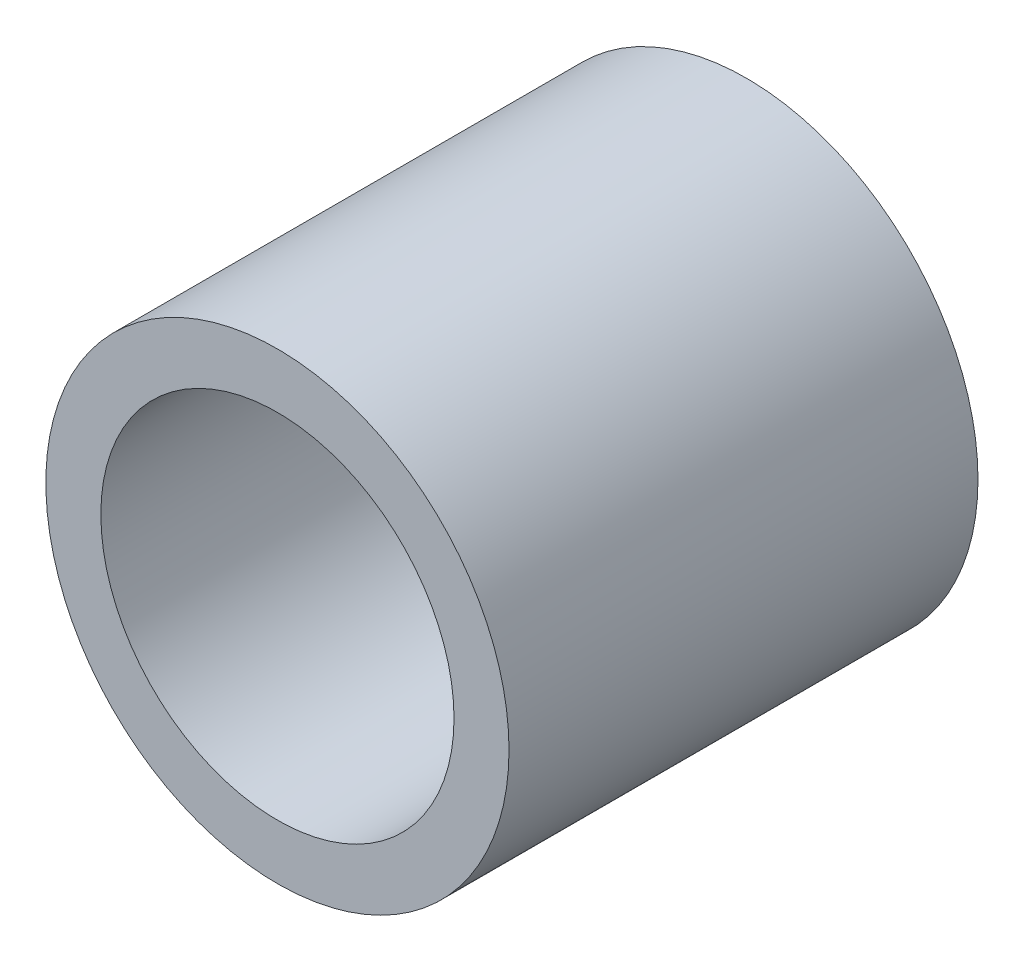
ISO-10303-21;
HEADER;
FILE_DESCRIPTION(('STEP AP214'),'2;1');
FILE_NAME('part.step','',(''),(''),'','','');
FILE_SCHEMA(('AUTOMOTIVE_DESIGN { 1 0 10303 214 1 1 1 1 }'));
ENDSEC;
DATA;
#1=APPLICATION_CONTEXT('core data for automotive mechanical design processes');
#2=APPLICATION_PROTOCOL_DEFINITION('international standard','automotive_design',2000,#1);
#3=PRODUCT_CONTEXT('',#1,'mechanical');
#4=PRODUCT('Part','Part','',(#3));
#5=PRODUCT_RELATED_PRODUCT_CATEGORY('part','',(#4));
#6=PRODUCT_DEFINITION_FORMATION('','',#4);
#7=PRODUCT_DEFINITION_CONTEXT('part definition',#1,'design');
#8=PRODUCT_DEFINITION('design','',#6,#7);
#9=PRODUCT_DEFINITION_SHAPE('','',#8);
#10=(LENGTH_UNIT() NAMED_UNIT(*) SI_UNIT(.MILLI.,.METRE.));
#11=(NAMED_UNIT(*) PLANE_ANGLE_UNIT() SI_UNIT($,.RADIAN.));
#12=(NAMED_UNIT(*) SI_UNIT($,.STERADIAN.) SOLID_ANGLE_UNIT());
#13=UNCERTAINTY_MEASURE_WITH_UNIT(LENGTH_MEASURE(1.E-05),#10,'distance_accuracy_value','');
#14=(GEOMETRIC_REPRESENTATION_CONTEXT(3) GLOBAL_UNCERTAINTY_ASSIGNED_CONTEXT((#13)) GLOBAL_UNIT_ASSIGNED_CONTEXT((#10,
#11,#12)) REPRESENTATION_CONTEXT('',''));
#15=CARTESIAN_POINT('',(0.,0.,0.));
#16=DIRECTION('',(0.,0.,1.));
#17=DIRECTION('',(1.,0.,0.));
#18=AXIS2_PLACEMENT_3D('',#15,#16,#17);
#19=CARTESIAN_POINT('',(0.,-0.812375766235954,8.1));
#20=DIRECTION('',(0.,0.,1.));
#21=DIRECTION('',(1.,0.,0.));
#22=AXIS2_PLACEMENT_3D('',#19,#20,#21);
#23=PLANE('',#22);
#24=CARTESIAN_POINT('',(0.,-0.812375766235954,8.1));
#25=DIRECTION('',(0.,0.,1.));
#26=DIRECTION('',(1.,0.,0.));
#27=AXIS2_PLACEMENT_3D('',#24,#25,#26);
#28=CIRCLE('',#27,4.);
#29=CARTESIAN_POINT('',(4.,-0.812375766235954,8.1));
#30=VERTEX_POINT('',#29);
#31=EDGE_CURVE('E10',#30,#30,#28,.T.);
#32=ORIENTED_EDGE('',*,*,#31,.T.);
#33=EDGE_LOOP('',(#32));
#34=FACE_BOUND('',#33,.T.);
#35=CARTESIAN_POINT('',(0.,-0.812375766235954,8.1));
#36=DIRECTION('',(0.,0.,1.));
#37=DIRECTION('',(1.,0.,0.));
#38=AXIS2_PLACEMENT_3D('',#35,#36,#37);
#39=CIRCLE('',#38,3.05);
#40=CARTESIAN_POINT('',(3.05,-0.812375766235954,8.1));
#41=VERTEX_POINT('',#40);
#42=EDGE_CURVE('E50',#41,#41,#39,.T.);
#43=ORIENTED_EDGE('',*,*,#42,.F.);
#44=EDGE_LOOP('',(#43));
#45=FACE_BOUND('',#44,.T.);
#46=ADVANCED_FACE('F37',(#34,#45),#23,.T.);
#47=CARTESIAN_POINT('',(0.,-0.812375766235954,0.));
#48=DIRECTION('',(0.,0.,1.));
#49=DIRECTION('',(1.,0.,0.));
#50=AXIS2_PLACEMENT_3D('',#47,#48,#49);
#51=PLANE('',#50);
#52=CARTESIAN_POINT('',(0.,-0.812375766235954,0.));
#53=DIRECTION('',(0.,0.,1.));
#54=DIRECTION('',(1.,0.,0.));
#55=AXIS2_PLACEMENT_3D('',#52,#53,#54);
#56=CIRCLE('',#55,4.);
#57=CARTESIAN_POINT('',(4.,-0.812375766235954,0.));
#58=VERTEX_POINT('',#57);
#59=EDGE_CURVE('E41',#58,#58,#56,.T.);
#60=ORIENTED_EDGE('',*,*,#59,.F.);
#61=EDGE_LOOP('',(#60));
#62=FACE_BOUND('',#61,.T.);
#63=CARTESIAN_POINT('',(0.,-0.812375766235954,0.));
#64=DIRECTION('',(0.,0.,1.));
#65=DIRECTION('',(1.,0.,0.));
#66=AXIS2_PLACEMENT_3D('',#63,#64,#65);
#67=CIRCLE('',#66,3.05);
#68=CARTESIAN_POINT('',(3.05,-0.812375766235954,0.));
#69=VERTEX_POINT('',#68);
#70=EDGE_CURVE('E52',#69,#69,#67,.T.);
#71=ORIENTED_EDGE('',*,*,#70,.T.);
#72=EDGE_LOOP('',(#71));
#73=FACE_BOUND('',#72,.T.);
#74=ADVANCED_FACE('F64',(#62,#73),#51,.F.);
#75=CARTESIAN_POINT('',(0.,-0.812375766235954,8.1));
#76=DIRECTION('',(0.,0.,-1.));
#77=DIRECTION('',(-1.,0.,0.));
#78=AXIS2_PLACEMENT_3D('',#75,#76,#77);
#79=CYLINDRICAL_SURFACE('',#78,4.);
#80=ORIENTED_EDGE('',*,*,#31,.F.);
#81=EDGE_LOOP('',(#80));
#82=FACE_BOUND('',#81,.T.);
#83=ORIENTED_EDGE('',*,*,#59,.T.);
#84=EDGE_LOOP('',(#83));
#85=FACE_BOUND('',#84,.T.);
#86=ADVANCED_FACE('F39',(#82,#85),#79,.T.);
#87=CARTESIAN_POINT('',(0.,-0.812375766235954,8.1));
#88=DIRECTION('',(0.,0.,-1.));
#89=DIRECTION('',(-1.,0.,0.));
#90=AXIS2_PLACEMENT_3D('',#87,#88,#89);
#91=CYLINDRICAL_SURFACE('',#90,3.05);
#92=ORIENTED_EDGE('',*,*,#42,.T.);
#93=EDGE_LOOP('',(#92));
#94=FACE_BOUND('',#93,.T.);
#95=ORIENTED_EDGE('',*,*,#70,.F.);
#96=EDGE_LOOP('',(#95));
#97=FACE_BOUND('',#96,.T.);
#98=ADVANCED_FACE('F60',(#94,#97),#91,.F.);
#99=CLOSED_SHELL('',(#46,#74,#86,#98));
#100=MANIFOLD_SOLID_BREP('B2',#99);
#101=ADVANCED_BREP_SHAPE_REPRESENTATION('',(#18,#100),#14);
#102=SHAPE_DEFINITION_REPRESENTATION(#9,#101);
ENDSEC;
END-ISO-10303-21;
